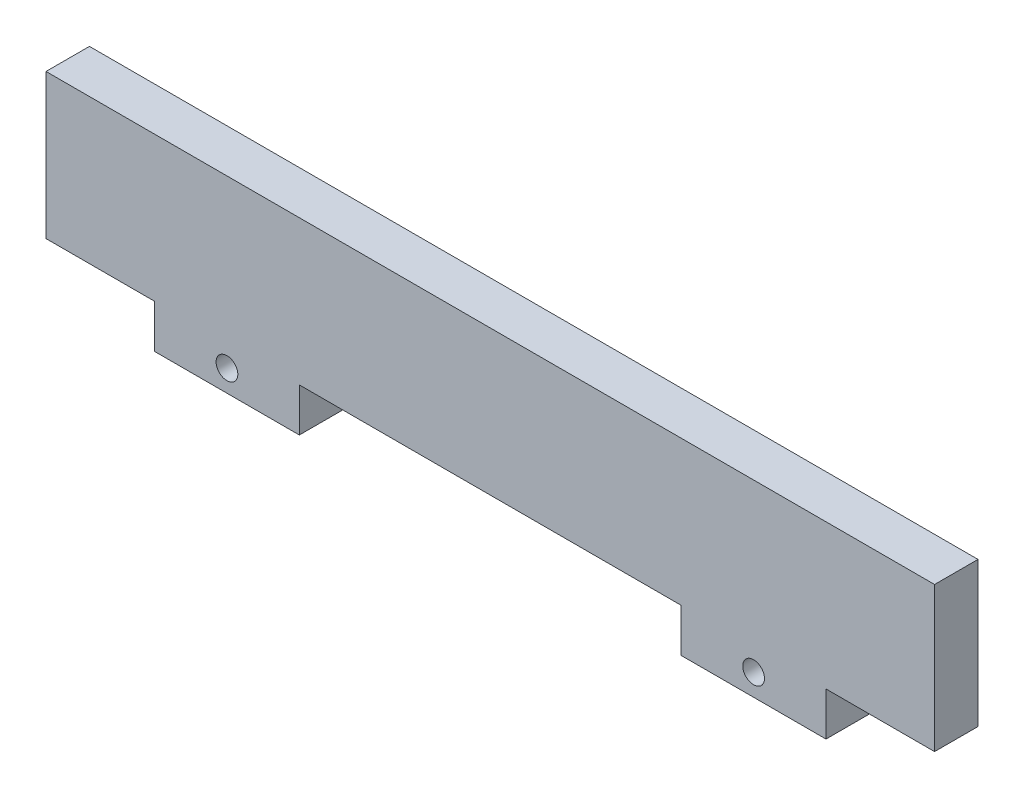
ISO-10303-21;
HEADER;
FILE_DESCRIPTION(('STEP AP214'),'2;1');
FILE_NAME('part.step','',(''),(''),'','','');
FILE_SCHEMA(('AUTOMOTIVE_DESIGN { 1 0 10303 214 1 1 1 1 }'));
ENDSEC;
DATA;
#1=APPLICATION_CONTEXT('core data for automotive mechanical design processes');
#2=APPLICATION_PROTOCOL_DEFINITION('international standard','automotive_design',2000,#1);
#3=PRODUCT_CONTEXT('',#1,'mechanical');
#4=PRODUCT('Part','Part','',(#3));
#5=PRODUCT_RELATED_PRODUCT_CATEGORY('part','',(#4));
#6=PRODUCT_DEFINITION_FORMATION('','',#4);
#7=PRODUCT_DEFINITION_CONTEXT('part definition',#1,'design');
#8=PRODUCT_DEFINITION('design','',#6,#7);
#9=PRODUCT_DEFINITION_SHAPE('','',#8);
#10=(LENGTH_UNIT() NAMED_UNIT(*) SI_UNIT(.MILLI.,.METRE.));
#11=(NAMED_UNIT(*) PLANE_ANGLE_UNIT() SI_UNIT($,.RADIAN.));
#12=(NAMED_UNIT(*) SI_UNIT($,.STERADIAN.) SOLID_ANGLE_UNIT());
#13=UNCERTAINTY_MEASURE_WITH_UNIT(LENGTH_MEASURE(1.E-05),#10,'distance_accuracy_value','');
#14=(GEOMETRIC_REPRESENTATION_CONTEXT(3) GLOBAL_UNCERTAINTY_ASSIGNED_CONTEXT((#13)) GLOBAL_UNIT_ASSIGNED_CONTEXT((#10,
#11,#12)) REPRESENTATION_CONTEXT('',''));
#15=CARTESIAN_POINT('',(0.,0.,0.));
#16=DIRECTION('',(0.,0.,1.));
#17=DIRECTION('',(1.,0.,0.));
#18=AXIS2_PLACEMENT_3D('',#15,#16,#17);
#19=CARTESIAN_POINT('',(-61.38,-10.,6.));
#20=DIRECTION('',(0.,1.,0.));
#21=DIRECTION('',(-1.,0.,0.));
#22=AXIS2_PLACEMENT_3D('',#19,#20,#21);
#23=PLANE('',#22);
#24=DIRECTION('',(1.,0.,0.));
#25=VECTOR('',#24,1.);
#26=CARTESIAN_POINT('',(-61.38,-10.,0.));
#27=LINE('',#26,#25);
#28=CARTESIAN_POINT('',(-26.38,-10.,0.));
#29=VERTEX_POINT('',#28);
#30=CARTESIAN_POINT('',(26.38,-10.,0.));
#31=VERTEX_POINT('',#30);
#32=EDGE_CURVE('E206',#29,#31,#27,.T.);
#33=ORIENTED_EDGE('',*,*,#32,.T.);
#34=DIRECTION('',(0.,0.,1.));
#35=VECTOR('',#34,1.);
#36=CARTESIAN_POINT('',(26.38,-10.,0.));
#37=LINE('',#36,#35);
#38=CARTESIAN_POINT('',(26.38,-10.,6.));
#39=VERTEX_POINT('',#38);
#40=EDGE_CURVE('E60',#31,#39,#37,.T.);
#41=ORIENTED_EDGE('',*,*,#40,.T.);
#42=DIRECTION('',(1.,0.,0.));
#43=VECTOR('',#42,1.);
#44=CARTESIAN_POINT('',(-61.38,-10.,6.));
#45=LINE('',#44,#43);
#46=CARTESIAN_POINT('',(-26.38,-10.,6.));
#47=VERTEX_POINT('',#46);
#48=EDGE_CURVE('E260',#47,#39,#45,.T.);
#49=ORIENTED_EDGE('',*,*,#48,.F.);
#50=DIRECTION('',(0.,0.,1.));
#51=VECTOR('',#50,1.);
#52=CARTESIAN_POINT('',(-26.38,-10.,0.));
#53=LINE('',#52,#51);
#54=EDGE_CURVE('E188',#29,#47,#53,.T.);
#55=ORIENTED_EDGE('',*,*,#54,.F.);
#56=EDGE_LOOP('',(#33,#41,#49,#55));
#57=FACE_BOUND('',#56,.T.);
#58=ADVANCED_FACE('F35',(#57),#23,.F.);
#59=CARTESIAN_POINT('',(46.38,-10.,6.));
#60=VERTEX_POINT('',#59);
#61=CARTESIAN_POINT('',(61.38,-10.,6.));
#62=VERTEX_POINT('',#61);
#63=EDGE_CURVE('E39',#60,#62,#45,.T.);
#64=ORIENTED_EDGE('',*,*,#63,.F.);
#65=DIRECTION('',(0.,0.,1.));
#66=VECTOR('',#65,1.);
#67=CARTESIAN_POINT('',(46.38,-10.,0.));
#68=LINE('',#67,#66);
#69=CARTESIAN_POINT('',(46.38,-10.,0.));
#70=VERTEX_POINT('',#69);
#71=EDGE_CURVE('E166',#70,#60,#68,.T.);
#72=ORIENTED_EDGE('',*,*,#71,.F.);
#73=CARTESIAN_POINT('',(61.38,-10.,0.));
#74=VERTEX_POINT('',#73);
#75=EDGE_CURVE('E204',#70,#74,#27,.T.);
#76=ORIENTED_EDGE('',*,*,#75,.T.);
#77=DIRECTION('',(0.,0.,-1.));
#78=VECTOR('',#77,1.);
#79=CARTESIAN_POINT('',(61.38,-10.,6.));
#80=LINE('',#79,#78);
#81=EDGE_CURVE('E45',#62,#74,#80,.T.);
#82=ORIENTED_EDGE('',*,*,#81,.F.);
#83=EDGE_LOOP('',(#64,#72,#76,#82));
#84=FACE_BOUND('',#83,.T.);
#85=ADVANCED_FACE('F262',(#84),#23,.F.);
#86=CARTESIAN_POINT('',(-61.38,10.,6.));
#87=DIRECTION('',(1.,0.,0.));
#88=DIRECTION('',(0.,0.,-1.));
#89=AXIS2_PLACEMENT_3D('',#86,#87,#88);
#90=PLANE('',#89);
#91=DIRECTION('',(0.,-1.,0.));
#92=VECTOR('',#91,1.);
#93=CARTESIAN_POINT('',(-61.38,10.,0.));
#94=LINE('',#93,#92);
#95=CARTESIAN_POINT('',(-61.38,10.,0.));
#96=VERTEX_POINT('',#95);
#97=CARTESIAN_POINT('',(-61.38,-10.,0.));
#98=VERTEX_POINT('',#97);
#99=EDGE_CURVE('E187',#96,#98,#94,.T.);
#100=ORIENTED_EDGE('',*,*,#99,.T.);
#101=DIRECTION('',(0.,0.,-1.));
#102=VECTOR('',#101,1.);
#103=CARTESIAN_POINT('',(-61.38,-10.,6.));
#104=LINE('',#103,#102);
#105=CARTESIAN_POINT('',(-61.38,-10.,6.));
#106=VERTEX_POINT('',#105);
#107=EDGE_CURVE('E11',#106,#98,#104,.T.);
#108=ORIENTED_EDGE('',*,*,#107,.F.);
#109=DIRECTION('',(0.,-1.,0.));
#110=VECTOR('',#109,1.);
#111=CARTESIAN_POINT('',(-61.38,10.,6.));
#112=LINE('',#111,#110);
#113=CARTESIAN_POINT('',(-61.38,10.,6.));
#114=VERTEX_POINT('',#113);
#115=EDGE_CURVE('E230',#114,#106,#112,.T.);
#116=ORIENTED_EDGE('',*,*,#115,.F.);
#117=DIRECTION('',(0.,0.,-1.));
#118=VECTOR('',#117,1.);
#119=CARTESIAN_POINT('',(-61.38,10.,6.));
#120=LINE('',#119,#118);
#121=EDGE_CURVE('E226',#114,#96,#120,.T.);
#122=ORIENTED_EDGE('',*,*,#121,.T.);
#123=EDGE_LOOP('',(#100,#108,#116,#122));
#124=FACE_BOUND('',#123,.T.);
#125=ADVANCED_FACE('F37',(#124),#90,.F.);
#126=CARTESIAN_POINT('',(-46.38,-10.,0.));
#127=VERTEX_POINT('',#126);
#128=EDGE_CURVE('E218',#98,#127,#27,.T.);
#129=ORIENTED_EDGE('',*,*,#128,.T.);
#130=DIRECTION('',(0.,0.,1.));
#131=VECTOR('',#130,1.);
#132=CARTESIAN_POINT('',(-46.38,-10.,0.));
#133=LINE('',#132,#131);
#134=CARTESIAN_POINT('',(-46.38,-10.,6.));
#135=VERTEX_POINT('',#134);
#136=EDGE_CURVE('E183',#127,#135,#133,.T.);
#137=ORIENTED_EDGE('',*,*,#136,.T.);
#138=EDGE_CURVE('E252',#106,#135,#45,.T.);
#139=ORIENTED_EDGE('',*,*,#138,.F.);
#140=ORIENTED_EDGE('',*,*,#107,.T.);
#141=EDGE_LOOP('',(#129,#137,#139,#140));
#142=FACE_BOUND('',#141,.T.);
#143=ADVANCED_FACE('F277',(#142),#23,.F.);
#144=CARTESIAN_POINT('',(61.38,10.,6.));
#145=DIRECTION('',(-1.,0.,0.));
#146=DIRECTION('',(0.,0.,1.));
#147=AXIS2_PLACEMENT_3D('',#144,#145,#146);
#148=PLANE('',#147);
#149=DIRECTION('',(0.,1.,0.));
#150=VECTOR('',#149,1.);
#151=CARTESIAN_POINT('',(61.38,10.,0.));
#152=LINE('',#151,#150);
#153=CARTESIAN_POINT('',(61.38,10.,0.));
#154=VERTEX_POINT('',#153);
#155=EDGE_CURVE('E211',#74,#154,#152,.T.);
#156=ORIENTED_EDGE('',*,*,#155,.T.);
#157=DIRECTION('',(0.,0.,-1.));
#158=VECTOR('',#157,1.);
#159=CARTESIAN_POINT('',(61.38,10.,6.));
#160=LINE('',#159,#158);
#161=CARTESIAN_POINT('',(61.38,10.,6.));
#162=VERTEX_POINT('',#161);
#163=EDGE_CURVE('E223',#162,#154,#160,.T.);
#164=ORIENTED_EDGE('',*,*,#163,.F.);
#165=DIRECTION('',(0.,1.,0.));
#166=VECTOR('',#165,1.);
#167=CARTESIAN_POINT('',(61.38,10.,6.));
#168=LINE('',#167,#166);
#169=EDGE_CURVE('E253',#62,#162,#168,.T.);
#170=ORIENTED_EDGE('',*,*,#169,.F.);
#171=ORIENTED_EDGE('',*,*,#81,.T.);
#172=EDGE_LOOP('',(#156,#164,#170,#171));
#173=FACE_BOUND('',#172,.T.);
#174=ADVANCED_FACE('F239',(#173),#148,.F.);
#175=CARTESIAN_POINT('',(-61.38,10.,6.));
#176=DIRECTION('',(0.,-1.,0.));
#177=DIRECTION('',(0.,0.,-1.));
#178=AXIS2_PLACEMENT_3D('',#175,#176,#177);
#179=PLANE('',#178);
#180=DIRECTION('',(-1.,0.,0.));
#181=VECTOR('',#180,1.);
#182=CARTESIAN_POINT('',(-61.38,10.,0.));
#183=LINE('',#182,#181);
#184=EDGE_CURVE('E229',#154,#96,#183,.T.);
#185=ORIENTED_EDGE('',*,*,#184,.T.);
#186=ORIENTED_EDGE('',*,*,#121,.F.);
#187=DIRECTION('',(-1.,0.,0.));
#188=VECTOR('',#187,1.);
#189=CARTESIAN_POINT('',(-61.38,10.,6.));
#190=LINE('',#189,#188);
#191=EDGE_CURVE('E228',#162,#114,#190,.T.);
#192=ORIENTED_EDGE('',*,*,#191,.F.);
#193=ORIENTED_EDGE('',*,*,#163,.T.);
#194=EDGE_LOOP('',(#185,#186,#192,#193));
#195=FACE_BOUND('',#194,.T.);
#196=ADVANCED_FACE('F242',(#195),#179,.F.);
#197=CARTESIAN_POINT('',(0.,0.,6.));
#198=DIRECTION('',(0.,0.,1.));
#199=DIRECTION('',(1.,0.,0.));
#200=AXIS2_PLACEMENT_3D('',#197,#198,#199);
#201=PLANE('',#200);
#202=CARTESIAN_POINT('',(36.38,-13.,6.));
#203=DIRECTION('',(0.,0.,1.));
#204=DIRECTION('',(1.,0.,0.));
#205=AXIS2_PLACEMENT_3D('',#202,#203,#204);
#206=CIRCLE('',#205,1.5);
#207=CARTESIAN_POINT('',(37.88,-13.,6.));
#208=VERTEX_POINT('',#207);
#209=EDGE_CURVE('E387',#208,#208,#206,.T.);
#210=ORIENTED_EDGE('',*,*,#209,.F.);
#211=EDGE_LOOP('',(#210));
#212=FACE_BOUND('',#211,.T.);
#213=CARTESIAN_POINT('',(-36.38,-13.,6.));
#214=DIRECTION('',(0.,0.,1.));
#215=DIRECTION('',(1.,0.,0.));
#216=AXIS2_PLACEMENT_3D('',#213,#214,#215);
#217=CIRCLE('',#216,1.5);
#218=CARTESIAN_POINT('',(-34.88,-13.,6.));
#219=VERTEX_POINT('',#218);
#220=EDGE_CURVE('E156',#219,#219,#217,.T.);
#221=ORIENTED_EDGE('',*,*,#220,.F.);
#222=EDGE_LOOP('',(#221));
#223=FACE_BOUND('',#222,.T.);
#224=ORIENTED_EDGE('',*,*,#115,.T.);
#225=ORIENTED_EDGE('',*,*,#138,.T.);
#226=DIRECTION('',(0.,-1.,0.));
#227=VECTOR('',#226,1.);
#228=CARTESIAN_POINT('',(-46.38,-10.,6.));
#229=LINE('',#228,#227);
#230=CARTESIAN_POINT('',(-46.38,-16.,6.));
#231=VERTEX_POINT('',#230);
#232=EDGE_CURVE('E165',#135,#231,#229,.T.);
#233=ORIENTED_EDGE('',*,*,#232,.T.);
#234=DIRECTION('',(1.,0.,0.));
#235=VECTOR('',#234,1.);
#236=CARTESIAN_POINT('',(-46.38,-16.,6.));
#237=LINE('',#236,#235);
#238=CARTESIAN_POINT('',(-26.38,-16.,6.));
#239=VERTEX_POINT('',#238);
#240=EDGE_CURVE('E174',#231,#239,#237,.T.);
#241=ORIENTED_EDGE('',*,*,#240,.T.);
#242=DIRECTION('',(0.,1.,0.));
#243=VECTOR('',#242,1.);
#244=CARTESIAN_POINT('',(-26.38,-10.,6.));
#245=LINE('',#244,#243);
#246=EDGE_CURVE('E177',#239,#47,#245,.T.);
#247=ORIENTED_EDGE('',*,*,#246,.T.);
#248=ORIENTED_EDGE('',*,*,#48,.T.);
#249=DIRECTION('',(0.,-1.,0.));
#250=VECTOR('',#249,1.);
#251=CARTESIAN_POINT('',(26.38,-10.,6.));
#252=LINE('',#251,#250);
#253=CARTESIAN_POINT('',(26.38,-16.,6.));
#254=VERTEX_POINT('',#253);
#255=EDGE_CURVE('E160',#39,#254,#252,.T.);
#256=ORIENTED_EDGE('',*,*,#255,.T.);
#257=DIRECTION('',(1.,0.,0.));
#258=VECTOR('',#257,1.);
#259=CARTESIAN_POINT('',(26.38,-16.,6.));
#260=LINE('',#259,#258);
#261=CARTESIAN_POINT('',(46.38,-16.,6.));
#262=VERTEX_POINT('',#261);
#263=EDGE_CURVE('E133',#254,#262,#260,.T.);
#264=ORIENTED_EDGE('',*,*,#263,.T.);
#265=DIRECTION('',(0.,1.,0.));
#266=VECTOR('',#265,1.);
#267=CARTESIAN_POINT('',(46.38,-10.,6.));
#268=LINE('',#267,#266);
#269=EDGE_CURVE('E151',#262,#60,#268,.T.);
#270=ORIENTED_EDGE('',*,*,#269,.T.);
#271=ORIENTED_EDGE('',*,*,#63,.T.);
#272=ORIENTED_EDGE('',*,*,#169,.T.);
#273=ORIENTED_EDGE('',*,*,#191,.T.);
#274=EDGE_LOOP('',(#224,#225,#233,#241,#247,#248,#256,#264,#270,#271,#272,#273));
#275=FACE_BOUND('',#274,.T.);
#276=ADVANCED_FACE('F250',(#212,#223,#275),#201,.T.);
#277=CARTESIAN_POINT('',(0.,0.,0.));
#278=DIRECTION('',(0.,0.,1.));
#279=DIRECTION('',(1.,0.,0.));
#280=AXIS2_PLACEMENT_3D('',#277,#278,#279);
#281=PLANE('',#280);
#282=CARTESIAN_POINT('',(36.38,-13.,0.));
#283=DIRECTION('',(0.,0.,1.));
#284=DIRECTION('',(1.,0.,0.));
#285=AXIS2_PLACEMENT_3D('',#282,#283,#284);
#286=CIRCLE('',#285,1.5);
#287=CARTESIAN_POINT('',(37.88,-13.,0.));
#288=VERTEX_POINT('',#287);
#289=EDGE_CURVE('E384',#288,#288,#286,.T.);
#290=ORIENTED_EDGE('',*,*,#289,.T.);
#291=EDGE_LOOP('',(#290));
#292=FACE_BOUND('',#291,.T.);
#293=CARTESIAN_POINT('',(-36.38,-13.,0.));
#294=DIRECTION('',(0.,0.,1.));
#295=DIRECTION('',(1.,0.,0.));
#296=AXIS2_PLACEMENT_3D('',#293,#294,#295);
#297=CIRCLE('',#296,1.5);
#298=CARTESIAN_POINT('',(-34.88,-13.,0.));
#299=VERTEX_POINT('',#298);
#300=EDGE_CURVE('E162',#299,#299,#297,.T.);
#301=ORIENTED_EDGE('',*,*,#300,.T.);
#302=EDGE_LOOP('',(#301));
#303=FACE_BOUND('',#302,.T.);
#304=ORIENTED_EDGE('',*,*,#99,.F.);
#305=ORIENTED_EDGE('',*,*,#184,.F.);
#306=ORIENTED_EDGE('',*,*,#155,.F.);
#307=ORIENTED_EDGE('',*,*,#75,.F.);
#308=DIRECTION('',(0.,1.,0.));
#309=VECTOR('',#308,1.);
#310=CARTESIAN_POINT('',(46.38,-10.,0.));
#311=LINE('',#310,#309);
#312=CARTESIAN_POINT('',(46.38,-16.,0.));
#313=VERTEX_POINT('',#312);
#314=EDGE_CURVE('E139',#313,#70,#311,.T.);
#315=ORIENTED_EDGE('',*,*,#314,.F.);
#316=DIRECTION('',(1.,0.,0.));
#317=VECTOR('',#316,1.);
#318=CARTESIAN_POINT('',(26.38,-16.,0.));
#319=LINE('',#318,#317);
#320=CARTESIAN_POINT('',(26.38,-16.,0.));
#321=VERTEX_POINT('',#320);
#322=EDGE_CURVE('E131',#321,#313,#319,.T.);
#323=ORIENTED_EDGE('',*,*,#322,.F.);
#324=DIRECTION('',(0.,-1.,0.));
#325=VECTOR('',#324,1.);
#326=CARTESIAN_POINT('',(26.38,-10.,0.));
#327=LINE('',#326,#325);
#328=EDGE_CURVE('E147',#31,#321,#327,.T.);
#329=ORIENTED_EDGE('',*,*,#328,.F.);
#330=ORIENTED_EDGE('',*,*,#32,.F.);
#331=DIRECTION('',(0.,1.,0.));
#332=VECTOR('',#331,1.);
#333=CARTESIAN_POINT('',(-26.38,-10.,0.));
#334=LINE('',#333,#332);
#335=CARTESIAN_POINT('',(-26.38,-16.,0.));
#336=VERTEX_POINT('',#335);
#337=EDGE_CURVE('E172',#336,#29,#334,.T.);
#338=ORIENTED_EDGE('',*,*,#337,.F.);
#339=DIRECTION('',(1.,0.,0.));
#340=VECTOR('',#339,1.);
#341=CARTESIAN_POINT('',(-46.38,-16.,0.));
#342=LINE('',#341,#340);
#343=CARTESIAN_POINT('',(-46.38,-16.,0.));
#344=VERTEX_POINT('',#343);
#345=EDGE_CURVE('E169',#344,#336,#342,.T.);
#346=ORIENTED_EDGE('',*,*,#345,.F.);
#347=DIRECTION('',(0.,-1.,0.));
#348=VECTOR('',#347,1.);
#349=CARTESIAN_POINT('',(-46.38,-10.,0.));
#350=LINE('',#349,#348);
#351=EDGE_CURVE('E173',#127,#344,#350,.T.);
#352=ORIENTED_EDGE('',*,*,#351,.F.);
#353=ORIENTED_EDGE('',*,*,#128,.F.);
#354=EDGE_LOOP('',(#304,#305,#306,#307,#315,#323,#329,#330,#338,#346,#352,#353));
#355=FACE_BOUND('',#354,.T.);
#356=ADVANCED_FACE('F145',(#292,#303,#355),#281,.F.);
#357=CARTESIAN_POINT('',(-46.38,-10.,0.));
#358=DIRECTION('',(-1.,0.,0.));
#359=DIRECTION('',(0.,0.,1.));
#360=AXIS2_PLACEMENT_3D('',#357,#358,#359);
#361=PLANE('',#360);
#362=ORIENTED_EDGE('',*,*,#232,.F.);
#363=ORIENTED_EDGE('',*,*,#136,.F.);
#364=ORIENTED_EDGE('',*,*,#351,.T.);
#365=DIRECTION('',(0.,0.,1.));
#366=VECTOR('',#365,1.);
#367=CARTESIAN_POINT('',(-46.38,-16.,0.));
#368=LINE('',#367,#366);
#369=EDGE_CURVE('E198',#344,#231,#368,.T.);
#370=ORIENTED_EDGE('',*,*,#369,.T.);
#371=EDGE_LOOP('',(#362,#363,#364,#370));
#372=FACE_BOUND('',#371,.T.);
#373=ADVANCED_FACE('F289',(#372),#361,.T.);
#374=CARTESIAN_POINT('',(-26.38,-10.,0.));
#375=DIRECTION('',(1.,0.,0.));
#376=DIRECTION('',(0.,1.,0.));
#377=AXIS2_PLACEMENT_3D('',#374,#375,#376);
#378=PLANE('',#377);
#379=ORIENTED_EDGE('',*,*,#246,.F.);
#380=DIRECTION('',(0.,0.,1.));
#381=VECTOR('',#380,1.);
#382=CARTESIAN_POINT('',(-26.38,-16.,0.));
#383=LINE('',#382,#381);
#384=EDGE_CURVE('E196',#336,#239,#383,.T.);
#385=ORIENTED_EDGE('',*,*,#384,.F.);
#386=ORIENTED_EDGE('',*,*,#337,.T.);
#387=ORIENTED_EDGE('',*,*,#54,.T.);
#388=EDGE_LOOP('',(#379,#385,#386,#387));
#389=FACE_BOUND('',#388,.T.);
#390=ADVANCED_FACE('F297',(#389),#378,.T.);
#391=CARTESIAN_POINT('',(-46.38,-16.,0.));
#392=DIRECTION('',(0.,-1.,0.));
#393=DIRECTION('',(1.,0.,0.));
#394=AXIS2_PLACEMENT_3D('',#391,#392,#393);
#395=PLANE('',#394);
#396=ORIENTED_EDGE('',*,*,#240,.F.);
#397=ORIENTED_EDGE('',*,*,#369,.F.);
#398=ORIENTED_EDGE('',*,*,#345,.T.);
#399=ORIENTED_EDGE('',*,*,#384,.T.);
#400=EDGE_LOOP('',(#396,#397,#398,#399));
#401=FACE_BOUND('',#400,.T.);
#402=ADVANCED_FACE('F273',(#401),#395,.T.);
#403=CARTESIAN_POINT('',(26.38,-10.,0.));
#404=DIRECTION('',(-1.,0.,0.));
#405=DIRECTION('',(0.,-1.,0.));
#406=AXIS2_PLACEMENT_3D('',#403,#404,#405);
#407=PLANE('',#406);
#408=ORIENTED_EDGE('',*,*,#255,.F.);
#409=ORIENTED_EDGE('',*,*,#40,.F.);
#410=ORIENTED_EDGE('',*,*,#328,.T.);
#411=DIRECTION('',(0.,0.,1.));
#412=VECTOR('',#411,1.);
#413=CARTESIAN_POINT('',(26.38,-16.,0.));
#414=LINE('',#413,#412);
#415=EDGE_CURVE('E128',#321,#254,#414,.T.);
#416=ORIENTED_EDGE('',*,*,#415,.T.);
#417=EDGE_LOOP('',(#408,#409,#410,#416));
#418=FACE_BOUND('',#417,.T.);
#419=ADVANCED_FACE('F150',(#418),#407,.T.);
#420=CARTESIAN_POINT('',(46.38,-10.,0.));
#421=DIRECTION('',(1.,0.,0.));
#422=DIRECTION('',(0.,0.,-1.));
#423=AXIS2_PLACEMENT_3D('',#420,#421,#422);
#424=PLANE('',#423);
#425=ORIENTED_EDGE('',*,*,#269,.F.);
#426=DIRECTION('',(0.,0.,1.));
#427=VECTOR('',#426,1.);
#428=CARTESIAN_POINT('',(46.38,-16.,0.));
#429=LINE('',#428,#427);
#430=EDGE_CURVE('E138',#313,#262,#429,.T.);
#431=ORIENTED_EDGE('',*,*,#430,.F.);
#432=ORIENTED_EDGE('',*,*,#314,.T.);
#433=ORIENTED_EDGE('',*,*,#71,.T.);
#434=EDGE_LOOP('',(#425,#431,#432,#433));
#435=FACE_BOUND('',#434,.T.);
#436=ADVANCED_FACE('F264',(#435),#424,.T.);
#437=CARTESIAN_POINT('',(26.38,-16.,0.));
#438=DIRECTION('',(0.,-1.,0.));
#439=DIRECTION('',(1.,0.,0.));
#440=AXIS2_PLACEMENT_3D('',#437,#438,#439);
#441=PLANE('',#440);
#442=ORIENTED_EDGE('',*,*,#263,.F.);
#443=ORIENTED_EDGE('',*,*,#415,.F.);
#444=ORIENTED_EDGE('',*,*,#322,.T.);
#445=ORIENTED_EDGE('',*,*,#430,.T.);
#446=EDGE_LOOP('',(#442,#443,#444,#445));
#447=FACE_BOUND('',#446,.T.);
#448=ADVANCED_FACE('F130',(#447),#441,.T.);
#449=CARTESIAN_POINT('',(-36.38,-13.,0.));
#450=DIRECTION('',(0.,0.,1.));
#451=DIRECTION('',(1.,0.,0.));
#452=AXIS2_PLACEMENT_3D('',#449,#450,#451);
#453=CYLINDRICAL_SURFACE('',#452,1.5);
#454=ORIENTED_EDGE('',*,*,#300,.F.);
#455=EDGE_LOOP('',(#454));
#456=FACE_BOUND('',#455,.T.);
#457=ORIENTED_EDGE('',*,*,#220,.T.);
#458=EDGE_LOOP('',(#457));
#459=FACE_BOUND('',#458,.T.);
#460=ADVANCED_FACE('F271',(#456,#459),#453,.F.);
#461=CARTESIAN_POINT('',(36.38,-13.,0.));
#462=DIRECTION('',(0.,0.,1.));
#463=DIRECTION('',(1.,0.,0.));
#464=AXIS2_PLACEMENT_3D('',#461,#462,#463);
#465=CYLINDRICAL_SURFACE('',#464,1.5);
#466=ORIENTED_EDGE('',*,*,#289,.F.);
#467=EDGE_LOOP('',(#466));
#468=FACE_BOUND('',#467,.T.);
#469=ORIENTED_EDGE('',*,*,#209,.T.);
#470=EDGE_LOOP('',(#469));
#471=FACE_BOUND('',#470,.T.);
#472=ADVANCED_FACE('F368',(#468,#471),#465,.F.);
#473=CLOSED_SHELL('',(#58,#85,#125,#143,#174,#196,#276,#356,#373,#390,#402,#419,#436,#448,#460,#472));
#474=MANIFOLD_SOLID_BREP('B2',#473);
#475=ADVANCED_BREP_SHAPE_REPRESENTATION('',(#18,#474),#14);
#476=SHAPE_DEFINITION_REPRESENTATION(#9,#475);
ENDSEC;
END-ISO-10303-21;
